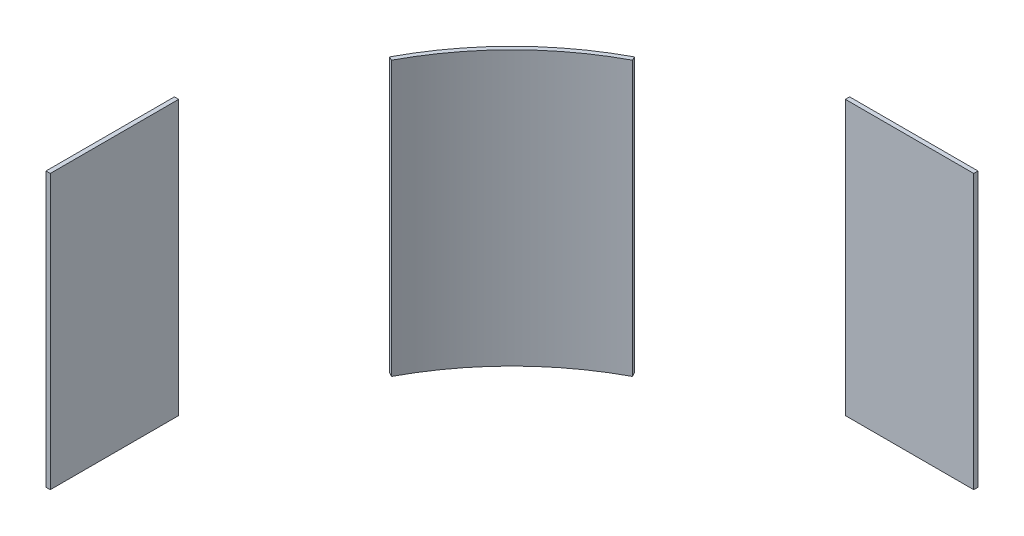
ISO-10303-21;
HEADER;
FILE_DESCRIPTION(('STEP AP214'),'2;1');
FILE_NAME('part.step','',(''),(''),'','','');
FILE_SCHEMA(('AUTOMOTIVE_DESIGN { 1 0 10303 214 1 1 1 1 }'));
ENDSEC;
DATA;
#1=APPLICATION_CONTEXT('core data for automotive mechanical design processes');
#2=APPLICATION_PROTOCOL_DEFINITION('international standard','automotive_design',2000,#1);
#3=PRODUCT_CONTEXT('',#1,'mechanical');
#4=PRODUCT('Part','Part','',(#3));
#5=PRODUCT_RELATED_PRODUCT_CATEGORY('part','',(#4));
#6=PRODUCT_DEFINITION_FORMATION('','',#4);
#7=PRODUCT_DEFINITION_CONTEXT('part definition',#1,'design');
#8=PRODUCT_DEFINITION('design','',#6,#7);
#9=PRODUCT_DEFINITION_SHAPE('','',#8);
#10=(LENGTH_UNIT() NAMED_UNIT(*) SI_UNIT(.MILLI.,.METRE.));
#11=(NAMED_UNIT(*) PLANE_ANGLE_UNIT() SI_UNIT($,.RADIAN.));
#12=(NAMED_UNIT(*) SI_UNIT($,.STERADIAN.) SOLID_ANGLE_UNIT());
#13=UNCERTAINTY_MEASURE_WITH_UNIT(LENGTH_MEASURE(1.E-05),#10,'distance_accuracy_value','');
#14=(GEOMETRIC_REPRESENTATION_CONTEXT(3) GLOBAL_UNCERTAINTY_ASSIGNED_CONTEXT((#13)) GLOBAL_UNIT_ASSIGNED_CONTEXT((#10,
#11,#12)) REPRESENTATION_CONTEXT('',''));
#15=CARTESIAN_POINT('',(0.,0.,0.));
#16=DIRECTION('',(0.,0.,1.));
#17=DIRECTION('',(1.,0.,0.));
#18=AXIS2_PLACEMENT_3D('',#15,#16,#17);
#19=CARTESIAN_POINT('',(-19.25,8.,7.72));
#20=DIRECTION('',(-1.,0.,0.));
#21=DIRECTION('',(0.,0.,1.));
#22=AXIS2_PLACEMENT_3D('',#19,#20,#21);
#23=PLANE('',#22);
#24=DIRECTION('',(0.,0.,-1.));
#25=VECTOR('',#24,1.);
#26=CARTESIAN_POINT('',(-19.25,-8.,7.72));
#27=LINE('',#26,#25);
#28=CARTESIAN_POINT('',(-19.25,-8.,7.72));
#29=VERTEX_POINT('',#28);
#30=CARTESIAN_POINT('',(-19.25,-8.,0.22));
#31=VERTEX_POINT('',#30);
#32=EDGE_CURVE('E108',#29,#31,#27,.T.);
#33=ORIENTED_EDGE('',*,*,#32,.T.);
#34=DIRECTION('',(0.,-1.,0.));
#35=VECTOR('',#34,1.);
#36=CARTESIAN_POINT('',(-19.25,8.,0.22));
#37=LINE('',#36,#35);
#38=CARTESIAN_POINT('',(-19.25,8.,0.22));
#39=VERTEX_POINT('',#38);
#40=EDGE_CURVE('E12',#39,#31,#37,.T.);
#41=ORIENTED_EDGE('',*,*,#40,.F.);
#42=DIRECTION('',(0.,0.,-1.));
#43=VECTOR('',#42,1.);
#44=CARTESIAN_POINT('',(-19.25,8.,7.72));
#45=LINE('',#44,#43);
#46=CARTESIAN_POINT('',(-19.25,8.,7.72));
#47=VERTEX_POINT('',#46);
#48=EDGE_CURVE('E96',#47,#39,#45,.T.);
#49=ORIENTED_EDGE('',*,*,#48,.F.);
#50=DIRECTION('',(0.,-1.,0.));
#51=VECTOR('',#50,1.);
#52=CARTESIAN_POINT('',(-19.25,8.,7.72));
#53=LINE('',#52,#51);
#54=EDGE_CURVE('E104',#47,#29,#53,.T.);
#55=ORIENTED_EDGE('',*,*,#54,.T.);
#56=EDGE_LOOP('',(#33,#41,#49,#55));
#57=FACE_BOUND('',#56,.T.);
#58=ADVANCED_FACE('F45',(#57),#23,.F.);
#59=CARTESIAN_POINT('',(-19.25,8.,0.22));
#60=DIRECTION('',(0.,0.,1.));
#61=DIRECTION('',(1.,0.,0.));
#62=AXIS2_PLACEMENT_3D('',#59,#60,#61);
#63=PLANE('',#62);
#64=DIRECTION('',(-1.,0.,0.));
#65=VECTOR('',#64,1.);
#66=CARTESIAN_POINT('',(-19.25,-8.,0.22));
#67=LINE('',#66,#65);
#68=CARTESIAN_POINT('',(-19.5,-8.,0.219999999999998));
#69=VERTEX_POINT('',#68);
#70=EDGE_CURVE('E100',#31,#69,#67,.T.);
#71=ORIENTED_EDGE('',*,*,#70,.T.);
#72=DIRECTION('',(0.,-1.,0.));
#73=VECTOR('',#72,1.);
#74=CARTESIAN_POINT('',(-19.5,8.,0.219999999999998));
#75=LINE('',#74,#73);
#76=CARTESIAN_POINT('',(-19.5,8.,0.219999999999998));
#77=VERTEX_POINT('',#76);
#78=EDGE_CURVE('E53',#77,#69,#75,.T.);
#79=ORIENTED_EDGE('',*,*,#78,.F.);
#80=DIRECTION('',(-1.,0.,0.));
#81=VECTOR('',#80,1.);
#82=CARTESIAN_POINT('',(-19.25,8.,0.22));
#83=LINE('',#82,#81);
#84=EDGE_CURVE('E91',#39,#77,#83,.T.);
#85=ORIENTED_EDGE('',*,*,#84,.F.);
#86=ORIENTED_EDGE('',*,*,#40,.T.);
#87=EDGE_LOOP('',(#71,#79,#85,#86));
#88=FACE_BOUND('',#87,.T.);
#89=ADVANCED_FACE('F99',(#88),#63,.F.);
#90=CARTESIAN_POINT('',(-19.5,8.,0.219999999999998));
#91=DIRECTION('',(1.,0.,0.));
#92=DIRECTION('',(0.,0.,-1.));
#93=AXIS2_PLACEMENT_3D('',#90,#91,#92);
#94=PLANE('',#93);
#95=DIRECTION('',(0.,0.,1.));
#96=VECTOR('',#95,1.);
#97=CARTESIAN_POINT('',(-19.5,-8.,0.219999999999998));
#98=LINE('',#97,#96);
#99=CARTESIAN_POINT('',(-19.5,-8.,7.72));
#100=VERTEX_POINT('',#99);
#101=EDGE_CURVE('E78',#69,#100,#98,.T.);
#102=ORIENTED_EDGE('',*,*,#101,.T.);
#103=DIRECTION('',(0.,-1.,0.));
#104=VECTOR('',#103,1.);
#105=CARTESIAN_POINT('',(-19.5,8.,7.72));
#106=LINE('',#105,#104);
#107=CARTESIAN_POINT('',(-19.5,8.,7.72));
#108=VERTEX_POINT('',#107);
#109=EDGE_CURVE('E101',#108,#100,#106,.T.);
#110=ORIENTED_EDGE('',*,*,#109,.F.);
#111=DIRECTION('',(0.,0.,1.));
#112=VECTOR('',#111,1.);
#113=CARTESIAN_POINT('',(-19.5,8.,0.219999999999998));
#114=LINE('',#113,#112);
#115=EDGE_CURVE('E94',#77,#108,#114,.T.);
#116=ORIENTED_EDGE('',*,*,#115,.F.);
#117=ORIENTED_EDGE('',*,*,#78,.T.);
#118=EDGE_LOOP('',(#102,#110,#116,#117));
#119=FACE_BOUND('',#118,.T.);
#120=ADVANCED_FACE('F102',(#119),#94,.F.);
#121=CARTESIAN_POINT('',(-19.5,8.,7.72));
#122=DIRECTION('',(0.,0.,-1.));
#123=DIRECTION('',(-1.,0.,0.));
#124=AXIS2_PLACEMENT_3D('',#121,#122,#123);
#125=PLANE('',#124);
#126=DIRECTION('',(1.,0.,0.));
#127=VECTOR('',#126,1.);
#128=CARTESIAN_POINT('',(-19.5,-8.,7.72));
#129=LINE('',#128,#127);
#130=EDGE_CURVE('E84',#100,#29,#129,.T.);
#131=ORIENTED_EDGE('',*,*,#130,.T.);
#132=ORIENTED_EDGE('',*,*,#54,.F.);
#133=DIRECTION('',(1.,0.,0.));
#134=VECTOR('',#133,1.);
#135=CARTESIAN_POINT('',(-19.5,8.,7.72));
#136=LINE('',#135,#134);
#137=EDGE_CURVE('E61',#108,#47,#136,.T.);
#138=ORIENTED_EDGE('',*,*,#137,.F.);
#139=ORIENTED_EDGE('',*,*,#109,.T.);
#140=EDGE_LOOP('',(#131,#132,#138,#139));
#141=FACE_BOUND('',#140,.T.);
#142=ADVANCED_FACE('F115',(#141),#125,.F.);
#143=CARTESIAN_POINT('',(-19.25,8.,0.22));
#144=DIRECTION('',(0.,1.,0.));
#145=DIRECTION('',(0.,0.,1.));
#146=AXIS2_PLACEMENT_3D('',#143,#144,#145);
#147=PLANE('',#146);
#148=ORIENTED_EDGE('',*,*,#48,.T.);
#149=ORIENTED_EDGE('',*,*,#84,.T.);
#150=ORIENTED_EDGE('',*,*,#115,.T.);
#151=ORIENTED_EDGE('',*,*,#137,.T.);
#152=EDGE_LOOP('',(#148,#149,#150,#151));
#153=FACE_BOUND('',#152,.T.);
#154=ADVANCED_FACE('F92',(#153),#147,.T.);
#155=CARTESIAN_POINT('',(-19.25,-8.,0.22));
#156=DIRECTION('',(0.,1.,0.));
#157=DIRECTION('',(0.,0.,1.));
#158=AXIS2_PLACEMENT_3D('',#155,#156,#157);
#159=PLANE('',#158);
#160=ORIENTED_EDGE('',*,*,#32,.F.);
#161=ORIENTED_EDGE('',*,*,#130,.F.);
#162=ORIENTED_EDGE('',*,*,#101,.F.);
#163=ORIENTED_EDGE('',*,*,#70,.F.);
#164=EDGE_LOOP('',(#160,#161,#162,#163));
#165=FACE_BOUND('',#164,.T.);
#166=ADVANCED_FACE('F118',(#165),#159,.F.);
#167=CLOSED_SHELL('',(#58,#89,#120,#142,#154,#166));
#168=MANIFOLD_SOLID_BREP('B2',#167);
#169=CARTESIAN_POINT('',(7.72,8.,-19.25));
#170=DIRECTION('',(0.,0.,-1.));
#171=DIRECTION('',(-1.,0.,0.));
#172=AXIS2_PLACEMENT_3D('',#169,#170,#171);
#173=PLANE('',#172);
#174=DIRECTION('',(1.,0.,0.));
#175=VECTOR('',#174,1.);
#176=CARTESIAN_POINT('',(7.72,-8.,-19.25));
#177=LINE('',#176,#175);
#178=CARTESIAN_POINT('',(0.219999999999996,-8.,-19.25));
#179=VERTEX_POINT('',#178);
#180=CARTESIAN_POINT('',(7.72,-8.,-19.25));
#181=VERTEX_POINT('',#180);
#182=EDGE_CURVE('E241',#179,#181,#177,.T.);
#183=ORIENTED_EDGE('',*,*,#182,.T.);
#184=DIRECTION('',(0.,-1.,0.));
#185=VECTOR('',#184,1.);
#186=CARTESIAN_POINT('',(7.72,8.,-19.25));
#187=LINE('',#186,#185);
#188=CARTESIAN_POINT('',(7.72,8.,-19.25));
#189=VERTEX_POINT('',#188);
#190=EDGE_CURVE('E43',#189,#181,#187,.T.);
#191=ORIENTED_EDGE('',*,*,#190,.F.);
#192=DIRECTION('',(1.,0.,0.));
#193=VECTOR('',#192,1.);
#194=CARTESIAN_POINT('',(7.72,8.,-19.25));
#195=LINE('',#194,#193);
#196=CARTESIAN_POINT('',(0.219999999999996,8.,-19.25));
#197=VERTEX_POINT('',#196);
#198=EDGE_CURVE('E229',#197,#189,#195,.T.);
#199=ORIENTED_EDGE('',*,*,#198,.F.);
#200=DIRECTION('',(0.,-1.,0.));
#201=VECTOR('',#200,1.);
#202=CARTESIAN_POINT('',(0.219999999999996,8.,-19.25));
#203=LINE('',#202,#201);
#204=EDGE_CURVE('E237',#197,#179,#203,.T.);
#205=ORIENTED_EDGE('',*,*,#204,.T.);
#206=EDGE_LOOP('',(#183,#191,#199,#205));
#207=FACE_BOUND('',#206,.T.);
#208=ADVANCED_FACE('F178',(#207),#173,.F.);
#209=CARTESIAN_POINT('',(7.72,8.,-19.5));
#210=DIRECTION('',(-1.,0.,0.));
#211=DIRECTION('',(0.,0.,1.));
#212=AXIS2_PLACEMENT_3D('',#209,#210,#211);
#213=PLANE('',#212);
#214=DIRECTION('',(0.,0.,-1.));
#215=VECTOR('',#214,1.);
#216=CARTESIAN_POINT('',(7.72,-8.,-19.5));
#217=LINE('',#216,#215);
#218=CARTESIAN_POINT('',(7.72,-8.,-19.5));
#219=VERTEX_POINT('',#218);
#220=EDGE_CURVE('E233',#181,#219,#217,.T.);
#221=ORIENTED_EDGE('',*,*,#220,.T.);
#222=DIRECTION('',(0.,-1.,0.));
#223=VECTOR('',#222,1.);
#224=CARTESIAN_POINT('',(7.72,8.,-19.5));
#225=LINE('',#224,#223);
#226=CARTESIAN_POINT('',(7.72,8.,-19.5));
#227=VERTEX_POINT('',#226);
#228=EDGE_CURVE('E186',#227,#219,#225,.T.);
#229=ORIENTED_EDGE('',*,*,#228,.F.);
#230=DIRECTION('',(0.,0.,-1.));
#231=VECTOR('',#230,1.);
#232=CARTESIAN_POINT('',(7.72,8.,-19.5));
#233=LINE('',#232,#231);
#234=EDGE_CURVE('E224',#189,#227,#233,.T.);
#235=ORIENTED_EDGE('',*,*,#234,.F.);
#236=ORIENTED_EDGE('',*,*,#190,.T.);
#237=EDGE_LOOP('',(#221,#229,#235,#236));
#238=FACE_BOUND('',#237,.T.);
#239=ADVANCED_FACE('F232',(#238),#213,.F.);
#240=CARTESIAN_POINT('',(0.219999999999996,8.,-19.5));
#241=DIRECTION('',(0.,0.,1.));
#242=DIRECTION('',(1.,0.,0.));
#243=AXIS2_PLACEMENT_3D('',#240,#241,#242);
#244=PLANE('',#243);
#245=DIRECTION('',(-1.,0.,0.));
#246=VECTOR('',#245,1.);
#247=CARTESIAN_POINT('',(0.219999999999996,-8.,-19.5));
#248=LINE('',#247,#246);
#249=CARTESIAN_POINT('',(0.219999999999996,-8.,-19.5));
#250=VERTEX_POINT('',#249);
#251=EDGE_CURVE('E211',#219,#250,#248,.T.);
#252=ORIENTED_EDGE('',*,*,#251,.T.);
#253=DIRECTION('',(0.,-1.,0.));
#254=VECTOR('',#253,1.);
#255=CARTESIAN_POINT('',(0.219999999999996,8.,-19.5));
#256=LINE('',#255,#254);
#257=CARTESIAN_POINT('',(0.219999999999996,8.,-19.5));
#258=VERTEX_POINT('',#257);
#259=EDGE_CURVE('E234',#258,#250,#256,.T.);
#260=ORIENTED_EDGE('',*,*,#259,.F.);
#261=DIRECTION('',(-1.,0.,0.));
#262=VECTOR('',#261,1.);
#263=CARTESIAN_POINT('',(0.219999999999996,8.,-19.5));
#264=LINE('',#263,#262);
#265=EDGE_CURVE('E227',#227,#258,#264,.T.);
#266=ORIENTED_EDGE('',*,*,#265,.F.);
#267=ORIENTED_EDGE('',*,*,#228,.T.);
#268=EDGE_LOOP('',(#252,#260,#266,#267));
#269=FACE_BOUND('',#268,.T.);
#270=ADVANCED_FACE('F235',(#269),#244,.F.);
#271=CARTESIAN_POINT('',(0.219999999999996,8.,-19.25));
#272=DIRECTION('',(1.,0.,0.));
#273=DIRECTION('',(0.,0.,-1.));
#274=AXIS2_PLACEMENT_3D('',#271,#272,#273);
#275=PLANE('',#274);
#276=DIRECTION('',(0.,0.,1.));
#277=VECTOR('',#276,1.);
#278=CARTESIAN_POINT('',(0.219999999999996,-8.,-19.25));
#279=LINE('',#278,#277);
#280=EDGE_CURVE('E217',#250,#179,#279,.T.);
#281=ORIENTED_EDGE('',*,*,#280,.T.);
#282=ORIENTED_EDGE('',*,*,#204,.F.);
#283=DIRECTION('',(0.,0.,1.));
#284=VECTOR('',#283,1.);
#285=CARTESIAN_POINT('',(0.219999999999996,8.,-19.25));
#286=LINE('',#285,#284);
#287=EDGE_CURVE('E194',#258,#197,#286,.T.);
#288=ORIENTED_EDGE('',*,*,#287,.F.);
#289=ORIENTED_EDGE('',*,*,#259,.T.);
#290=EDGE_LOOP('',(#281,#282,#288,#289));
#291=FACE_BOUND('',#290,.T.);
#292=ADVANCED_FACE('F248',(#291),#275,.F.);
#293=CARTESIAN_POINT('',(0.219999999999996,8.,-19.25));
#294=DIRECTION('',(0.,-1.,0.));
#295=DIRECTION('',(0.,0.,-1.));
#296=AXIS2_PLACEMENT_3D('',#293,#294,#295);
#297=PLANE('',#296);
#298=ORIENTED_EDGE('',*,*,#198,.T.);
#299=ORIENTED_EDGE('',*,*,#234,.T.);
#300=ORIENTED_EDGE('',*,*,#265,.T.);
#301=ORIENTED_EDGE('',*,*,#287,.T.);
#302=EDGE_LOOP('',(#298,#299,#300,#301));
#303=FACE_BOUND('',#302,.T.);
#304=ADVANCED_FACE('F225',(#303),#297,.F.);
#305=CARTESIAN_POINT('',(0.219999999999996,-8.,-19.25));
#306=DIRECTION('',(0.,-1.,0.));
#307=DIRECTION('',(0.,0.,-1.));
#308=AXIS2_PLACEMENT_3D('',#305,#306,#307);
#309=PLANE('',#308);
#310=ORIENTED_EDGE('',*,*,#182,.F.);
#311=ORIENTED_EDGE('',*,*,#280,.F.);
#312=ORIENTED_EDGE('',*,*,#251,.F.);
#313=ORIENTED_EDGE('',*,*,#220,.F.);
#314=EDGE_LOOP('',(#310,#311,#312,#313));
#315=FACE_BOUND('',#314,.T.);
#316=ADVANCED_FACE('F251',(#315),#309,.T.);
#317=CLOSED_SHELL('',(#208,#239,#270,#292,#304,#316));
#318=MANIFOLD_SOLID_BREP('B6',#317);
#319=CARTESIAN_POINT('',(0.,8.,0.));
#320=DIRECTION('',(0.,-1.,0.));
#321=DIRECTION('',(0.,0.,-1.));
#322=AXIS2_PLACEMENT_3D('',#319,#320,#321);
#323=CYLINDRICAL_SURFACE('',#322,17.);
#324=CARTESIAN_POINT('',(0.,-8.,0.));
#325=DIRECTION('',(0.,-1.,0.));
#326=DIRECTION('',(0.,0.,-1.));
#327=AXIS2_PLACEMENT_3D('',#324,#325,#326);
#328=CIRCLE('',#327,17.);
#329=CARTESIAN_POINT('',(-15.0138383537492,-8.,-7.97399886427698));
#330=VERTEX_POINT('',#329);
#331=CARTESIAN_POINT('',(-7.97399886427698,-8.,-15.0138383537492));
#332=VERTEX_POINT('',#331);
#333=EDGE_CURVE('E365',#330,#332,#328,.T.);
#334=ORIENTED_EDGE('',*,*,#333,.T.);
#335=DIRECTION('',(0.,-1.,0.));
#336=VECTOR('',#335,1.);
#337=CARTESIAN_POINT('',(-7.97399886427698,8.,-15.0138383537492));
#338=LINE('',#337,#336);
#339=CARTESIAN_POINT('',(-7.97399886427698,8.,-15.0138383537492));
#340=VERTEX_POINT('',#339);
#341=EDGE_CURVE('E176',#340,#332,#338,.T.);
#342=ORIENTED_EDGE('',*,*,#341,.F.);
#343=CARTESIAN_POINT('',(0.,8.,0.));
#344=DIRECTION('',(0.,-1.,0.));
#345=DIRECTION('',(0.,0.,-1.));
#346=AXIS2_PLACEMENT_3D('',#343,#344,#345);
#347=CIRCLE('',#346,17.);
#348=CARTESIAN_POINT('',(-15.0138383537492,8.,-7.97399886427698));
#349=VERTEX_POINT('',#348);
#350=EDGE_CURVE('E353',#349,#340,#347,.T.);
#351=ORIENTED_EDGE('',*,*,#350,.F.);
#352=DIRECTION('',(0.,-1.,0.));
#353=VECTOR('',#352,1.);
#354=CARTESIAN_POINT('',(-15.0138383537492,8.,-7.97399886427698));
#355=LINE('',#354,#353);
#356=EDGE_CURVE('E361',#349,#330,#355,.T.);
#357=ORIENTED_EDGE('',*,*,#356,.T.);
#358=EDGE_LOOP('',(#334,#342,#351,#357));
#359=FACE_BOUND('',#358,.T.);
#360=ADVANCED_FACE('F302',(#359),#323,.F.);
#361=CARTESIAN_POINT('',(-8.09126355345753,8.,-15.2346300942455));
#362=DIRECTION('',(-0.883166961985237,0.,0.46905875672219));
#363=DIRECTION('',(0.46905875672219,0.,0.883166961985237));
#364=AXIS2_PLACEMENT_3D('',#361,#362,#363);
#365=PLANE('',#364);
#366=DIRECTION('',(-0.46905875672219,0.,-0.883166961985237));
#367=VECTOR('',#366,1.);
#368=CARTESIAN_POINT('',(-8.09126355345753,-8.,-15.2346300942455));
#369=LINE('',#368,#367);
#370=CARTESIAN_POINT('',(-8.09126355345753,-8.,-15.2346300942455));
#371=VERTEX_POINT('',#370);
#372=EDGE_CURVE('E357',#332,#371,#369,.T.);
#373=ORIENTED_EDGE('',*,*,#372,.T.);
#374=DIRECTION('',(0.,-1.,0.));
#375=VECTOR('',#374,1.);
#376=CARTESIAN_POINT('',(-8.09126355345753,8.,-15.2346300942455));
#377=LINE('',#376,#375);
#378=CARTESIAN_POINT('',(-8.09126355345753,8.,-15.2346300942455));
#379=VERTEX_POINT('',#378);
#380=EDGE_CURVE('E310',#379,#371,#377,.T.);
#381=ORIENTED_EDGE('',*,*,#380,.F.);
#382=DIRECTION('',(-0.46905875672219,0.,-0.883166961985237));
#383=VECTOR('',#382,1.);
#384=CARTESIAN_POINT('',(-8.09126355345753,8.,-15.2346300942455));
#385=LINE('',#384,#383);
#386=EDGE_CURVE('E348',#340,#379,#385,.T.);
#387=ORIENTED_EDGE('',*,*,#386,.F.);
#388=ORIENTED_EDGE('',*,*,#341,.T.);
#389=EDGE_LOOP('',(#373,#381,#387,#388));
#390=FACE_BOUND('',#389,.T.);
#391=ADVANCED_FACE('F356',(#390),#365,.F.);
#392=CARTESIAN_POINT('',(0.,8.,0.));
#393=DIRECTION('',(0.,-1.,0.));
#394=DIRECTION('',(0.,0.,-1.));
#395=AXIS2_PLACEMENT_3D('',#392,#393,#394);
#396=CYLINDRICAL_SURFACE('',#395,17.25);
#397=CARTESIAN_POINT('',(0.,-8.,0.));
#398=DIRECTION('',(0.,1.,0.));
#399=DIRECTION('',(0.,0.,-1.));
#400=AXIS2_PLACEMENT_3D('',#397,#398,#399);
#401=CIRCLE('',#400,17.25);
#402=CARTESIAN_POINT('',(-15.2346300942455,-8.,-8.09126355345752));
#403=VERTEX_POINT('',#402);
#404=EDGE_CURVE('E335',#371,#403,#401,.T.);
#405=ORIENTED_EDGE('',*,*,#404,.T.);
#406=DIRECTION('',(0.,-1.,0.));
#407=VECTOR('',#406,1.);
#408=CARTESIAN_POINT('',(-15.2346300942455,8.,-8.09126355345752));
#409=LINE('',#408,#407);
#410=CARTESIAN_POINT('',(-15.2346300942455,8.,-8.09126355345752));
#411=VERTEX_POINT('',#410);
#412=EDGE_CURVE('E358',#411,#403,#409,.T.);
#413=ORIENTED_EDGE('',*,*,#412,.F.);
#414=CARTESIAN_POINT('',(0.,8.,0.));
#415=DIRECTION('',(0.,1.,0.));
#416=DIRECTION('',(0.,0.,-1.));
#417=AXIS2_PLACEMENT_3D('',#414,#415,#416);
#418=CIRCLE('',#417,17.25);
#419=EDGE_CURVE('E351',#379,#411,#418,.T.);
#420=ORIENTED_EDGE('',*,*,#419,.F.);
#421=ORIENTED_EDGE('',*,*,#380,.T.);
#422=EDGE_LOOP('',(#405,#413,#420,#421));
#423=FACE_BOUND('',#422,.T.);
#424=ADVANCED_FACE('F359',(#423),#396,.T.);
#425=CARTESIAN_POINT('',(-15.2346300942455,8.,-8.09126355345752));
#426=DIRECTION('',(0.469058756722159,0.,-0.883166961985254));
#427=DIRECTION('',(-0.883166961985254,0.,-0.469058756722159));
#428=AXIS2_PLACEMENT_3D('',#425,#426,#427);
#429=PLANE('',#428);
#430=DIRECTION('',(0.883166961985254,0.,0.469058756722159));
#431=VECTOR('',#430,1.);
#432=CARTESIAN_POINT('',(-15.2346300942455,-8.,-8.09126355345752));
#433=LINE('',#432,#431);
#434=EDGE_CURVE('E341',#403,#330,#433,.T.);
#435=ORIENTED_EDGE('',*,*,#434,.T.);
#436=ORIENTED_EDGE('',*,*,#356,.F.);
#437=DIRECTION('',(0.883166961985254,0.,0.469058756722159));
#438=VECTOR('',#437,1.);
#439=CARTESIAN_POINT('',(-15.2346300942455,8.,-8.09126355345752));
#440=LINE('',#439,#438);
#441=EDGE_CURVE('E318',#411,#349,#440,.T.);
#442=ORIENTED_EDGE('',*,*,#441,.F.);
#443=ORIENTED_EDGE('',*,*,#412,.T.);
#444=EDGE_LOOP('',(#435,#436,#442,#443));
#445=FACE_BOUND('',#444,.T.);
#446=ADVANCED_FACE('F372',(#445),#429,.F.);
#447=CARTESIAN_POINT('',(0.,8.,0.));
#448=DIRECTION('',(0.,-1.,0.));
#449=DIRECTION('',(0.,0.,-1.));
#450=AXIS2_PLACEMENT_3D('',#447,#448,#449);
#451=PLANE('',#450);
#452=ORIENTED_EDGE('',*,*,#350,.T.);
#453=ORIENTED_EDGE('',*,*,#386,.T.);
#454=ORIENTED_EDGE('',*,*,#419,.T.);
#455=ORIENTED_EDGE('',*,*,#441,.T.);
#456=EDGE_LOOP('',(#452,#453,#454,#455));
#457=FACE_BOUND('',#456,.T.);
#458=ADVANCED_FACE('F349',(#457),#451,.F.);
#459=CARTESIAN_POINT('',(0.,-8.,0.));
#460=DIRECTION('',(0.,-1.,0.));
#461=DIRECTION('',(0.,0.,-1.));
#462=AXIS2_PLACEMENT_3D('',#459,#460,#461);
#463=PLANE('',#462);
#464=ORIENTED_EDGE('',*,*,#333,.F.);
#465=ORIENTED_EDGE('',*,*,#434,.F.);
#466=ORIENTED_EDGE('',*,*,#404,.F.);
#467=ORIENTED_EDGE('',*,*,#372,.F.);
#468=EDGE_LOOP('',(#464,#465,#466,#467));
#469=FACE_BOUND('',#468,.T.);
#470=ADVANCED_FACE('F375',(#469),#463,.T.);
#471=CLOSED_SHELL('',(#360,#391,#424,#446,#458,#470));
#472=MANIFOLD_SOLID_BREP('B37',#471);
#473=ADVANCED_BREP_SHAPE_REPRESENTATION('',(#18,#168,#318,#472),#14);
#474=SHAPE_DEFINITION_REPRESENTATION(#9,#473);
ENDSEC;
END-ISO-10303-21;
